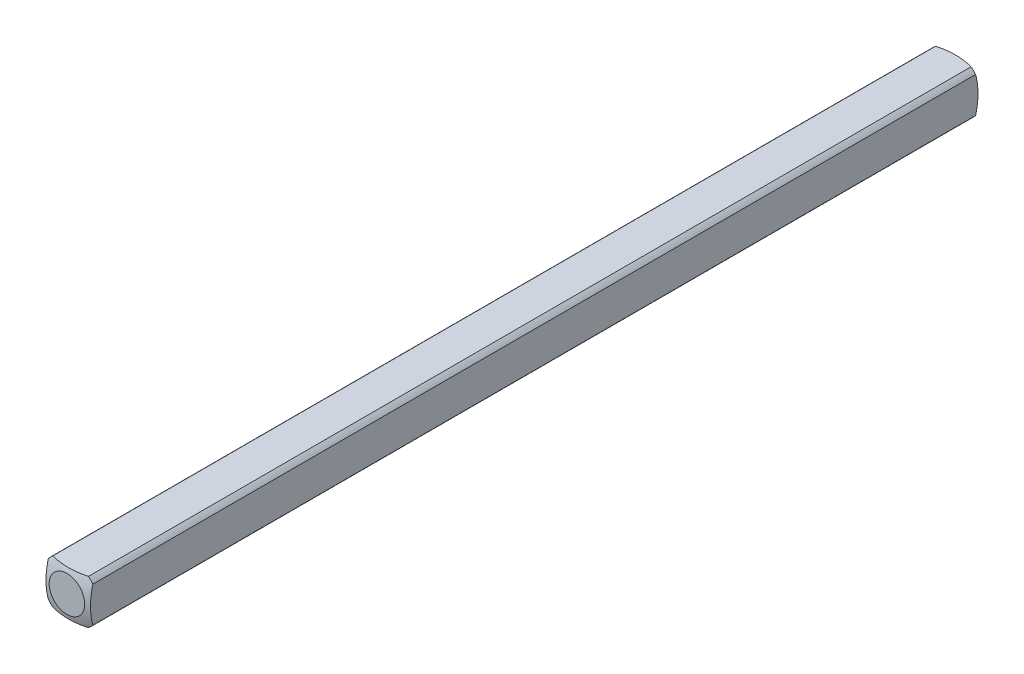
ISO-10303-21;
HEADER;
FILE_DESCRIPTION(('STEP AP214'),'2;1');
FILE_NAME('part.step','',(''),(''),'','','');
FILE_SCHEMA(('AUTOMOTIVE_DESIGN { 1 0 10303 214 1 1 1 1 }'));
ENDSEC;
DATA;
#1=APPLICATION_CONTEXT('core data for automotive mechanical design processes');
#2=APPLICATION_PROTOCOL_DEFINITION('international standard','automotive_design',2000,#1);
#3=PRODUCT_CONTEXT('',#1,'mechanical');
#4=PRODUCT('Part','Part','',(#3));
#5=PRODUCT_RELATED_PRODUCT_CATEGORY('part','',(#4));
#6=PRODUCT_DEFINITION_FORMATION('','',#4);
#7=PRODUCT_DEFINITION_CONTEXT('part definition',#1,'design');
#8=PRODUCT_DEFINITION('design','',#6,#7);
#9=PRODUCT_DEFINITION_SHAPE('','',#8);
#10=(LENGTH_UNIT() NAMED_UNIT(*) SI_UNIT(.MILLI.,.METRE.));
#11=(NAMED_UNIT(*) PLANE_ANGLE_UNIT() SI_UNIT($,.RADIAN.));
#12=(NAMED_UNIT(*) SI_UNIT($,.STERADIAN.) SOLID_ANGLE_UNIT());
#13=UNCERTAINTY_MEASURE_WITH_UNIT(LENGTH_MEASURE(1.E-05),#10,'distance_accuracy_value','');
#14=(GEOMETRIC_REPRESENTATION_CONTEXT(3) GLOBAL_UNCERTAINTY_ASSIGNED_CONTEXT((#13)) GLOBAL_UNIT_ASSIGNED_CONTEXT((#10,
#11,#12)) REPRESENTATION_CONTEXT('',''));
#15=CARTESIAN_POINT('',(0.,0.,0.));
#16=DIRECTION('',(0.,0.,1.));
#17=DIRECTION('',(1.,0.,0.));
#18=AXIS2_PLACEMENT_3D('',#15,#16,#17);
#19=CARTESIAN_POINT('',(-1.5875,-1.5875,31.75));
#20=DIRECTION('',(1.,0.,0.));
#21=DIRECTION('',(0.,0.,-1.));
#22=AXIS2_PLACEMENT_3D('',#19,#20,#21);
#23=PLANE('',#22);
#24=CARTESIAN_POINT('',(-1.5875,0.,4.91912226376204));
#25=DIRECTION('',(1.,0.,0.));
#26=DIRECTION('',(0.,0.,-1.));
#27=AXIS2_PLACEMENT_3D('',#24,#25,#26);
#28=CIRCLE('',#27,4.82558221875869);
#29=CARTESIAN_POINT('',(-1.5875,-1.26841150657032,0.263225357686904));
#30=VERTEX_POINT('',#29);
#31=CARTESIAN_POINT('',(-1.5875,1.26841150657032,0.263225357686907));
#32=VERTEX_POINT('',#31);
#33=EDGE_CURVE('E49',#30,#32,#28,.T.);
#34=ORIENTED_EDGE('',*,*,#33,.F.);
#35=DIRECTION('',(0.,0.,-1.));
#36=VECTOR('',#35,1.);
#37=CARTESIAN_POINT('',(-1.5875,-1.26841150657032,31.75));
#38=LINE('',#37,#36);
#39=CARTESIAN_POINT('',(-1.5875,-1.26841150657032,63.2367746423131));
#40=VERTEX_POINT('',#39);
#41=EDGE_CURVE('E42',#40,#30,#38,.T.);
#42=ORIENTED_EDGE('',*,*,#41,.F.);
#43=CARTESIAN_POINT('',(-1.5875,0.,58.580877736238));
#44=DIRECTION('',(-1.,0.,0.));
#45=DIRECTION('',(0.,0.,1.));
#46=AXIS2_PLACEMENT_3D('',#43,#44,#45);
#47=CIRCLE('',#46,4.82558221875869);
#48=CARTESIAN_POINT('',(-1.5875,1.26841150657032,63.2367746423131));
#49=VERTEX_POINT('',#48);
#50=EDGE_CURVE('E125',#40,#49,#47,.T.);
#51=ORIENTED_EDGE('',*,*,#50,.T.);
#52=DIRECTION('',(0.,0.,-1.));
#53=VECTOR('',#52,1.);
#54=CARTESIAN_POINT('',(-1.5875,1.26841150657032,31.75));
#55=LINE('',#54,#53);
#56=EDGE_CURVE('E113',#32,#49,#55,.F.);
#57=ORIENTED_EDGE('',*,*,#56,.F.);
#58=EDGE_LOOP('',(#34,#42,#51,#57));
#59=FACE_BOUND('',#58,.T.);
#60=ADVANCED_FACE('F35',(#59),#23,.F.);
#61=CARTESIAN_POINT('',(-1.5875,-1.5875,31.75));
#62=DIRECTION('',(0.,1.,0.));
#63=DIRECTION('',(0.,0.,1.));
#64=AXIS2_PLACEMENT_3D('',#61,#62,#63);
#65=PLANE('',#64);
#66=CARTESIAN_POINT('',(0.,-1.5875,4.91912226376204));
#67=DIRECTION('',(0.,1.,0.));
#68=DIRECTION('',(0.,0.,1.));
#69=AXIS2_PLACEMENT_3D('',#66,#67,#68);
#70=CIRCLE('',#69,4.82558221875869);
#71=CARTESIAN_POINT('',(1.26841150657032,-1.5875,0.263225357686905));
#72=VERTEX_POINT('',#71);
#73=CARTESIAN_POINT('',(-1.26841150657032,-1.5875,0.263225357686904));
#74=VERTEX_POINT('',#73);
#75=EDGE_CURVE('E154',#72,#74,#70,.T.);
#76=ORIENTED_EDGE('',*,*,#75,.F.);
#77=DIRECTION('',(0.,0.,-1.));
#78=VECTOR('',#77,1.);
#79=CARTESIAN_POINT('',(1.26841150657032,-1.5875,31.75));
#80=LINE('',#79,#78);
#81=CARTESIAN_POINT('',(1.26841150657032,-1.5875,63.2367746423131));
#82=VERTEX_POINT('',#81);
#83=EDGE_CURVE('E167',#82,#72,#80,.T.);
#84=ORIENTED_EDGE('',*,*,#83,.F.);
#85=CARTESIAN_POINT('',(0.,-1.5875,58.580877736238));
#86=DIRECTION('',(0.,-1.,0.));
#87=DIRECTION('',(0.,0.,-1.));
#88=AXIS2_PLACEMENT_3D('',#85,#86,#87);
#89=CIRCLE('',#88,4.82558221875869);
#90=CARTESIAN_POINT('',(-1.26841150657032,-1.5875,63.2367746423131));
#91=VERTEX_POINT('',#90);
#92=EDGE_CURVE('E136',#82,#91,#89,.T.);
#93=ORIENTED_EDGE('',*,*,#92,.T.);
#94=DIRECTION('',(0.,0.,-1.));
#95=VECTOR('',#94,1.);
#96=CARTESIAN_POINT('',(-1.26841150657032,-1.5875,31.75));
#97=LINE('',#96,#95);
#98=EDGE_CURVE('E165',#74,#91,#97,.F.);
#99=ORIENTED_EDGE('',*,*,#98,.F.);
#100=EDGE_LOOP('',(#76,#84,#93,#99));
#101=FACE_BOUND('',#100,.T.);
#102=ADVANCED_FACE('F177',(#101),#65,.F.);
#103=CARTESIAN_POINT('',(1.5875,-1.5875,31.75));
#104=DIRECTION('',(-1.,0.,0.));
#105=DIRECTION('',(0.,0.,1.));
#106=AXIS2_PLACEMENT_3D('',#103,#104,#105);
#107=PLANE('',#106);
#108=CARTESIAN_POINT('',(1.5875,0.,4.91912226376204));
#109=DIRECTION('',(-1.,0.,0.));
#110=DIRECTION('',(0.,0.,1.));
#111=AXIS2_PLACEMENT_3D('',#108,#109,#110);
#112=CIRCLE('',#111,4.82558221875869);
#113=CARTESIAN_POINT('',(1.5875,1.26841150657032,0.263225357686904));
#114=VERTEX_POINT('',#113);
#115=CARTESIAN_POINT('',(1.5875,-1.26841150657032,0.263225357686904));
#116=VERTEX_POINT('',#115);
#117=EDGE_CURVE('E152',#114,#116,#112,.T.);
#118=ORIENTED_EDGE('',*,*,#117,.F.);
#119=DIRECTION('',(0.,0.,-1.));
#120=VECTOR('',#119,1.);
#121=CARTESIAN_POINT('',(1.5875,1.26841150657032,31.75));
#122=LINE('',#121,#120);
#123=CARTESIAN_POINT('',(1.5875,1.26841150657032,63.2367746423131));
#124=VERTEX_POINT('',#123);
#125=EDGE_CURVE('E162',#124,#114,#122,.T.);
#126=ORIENTED_EDGE('',*,*,#125,.F.);
#127=CARTESIAN_POINT('',(1.5875,0.,58.580877736238));
#128=DIRECTION('',(1.,0.,0.));
#129=DIRECTION('',(0.,0.,-1.));
#130=AXIS2_PLACEMENT_3D('',#127,#128,#129);
#131=CIRCLE('',#130,4.82558221875869);
#132=CARTESIAN_POINT('',(1.5875,-1.26841150657032,63.2367746423131));
#133=VERTEX_POINT('',#132);
#134=EDGE_CURVE('E133',#124,#133,#131,.T.);
#135=ORIENTED_EDGE('',*,*,#134,.T.);
#136=DIRECTION('',(0.,0.,-1.));
#137=VECTOR('',#136,1.);
#138=CARTESIAN_POINT('',(1.5875,-1.26841150657032,31.75));
#139=LINE('',#138,#137);
#140=EDGE_CURVE('E106',#116,#133,#139,.F.);
#141=ORIENTED_EDGE('',*,*,#140,.F.);
#142=EDGE_LOOP('',(#118,#126,#135,#141));
#143=FACE_BOUND('',#142,.T.);
#144=ADVANCED_FACE('F184',(#143),#107,.F.);
#145=CARTESIAN_POINT('',(-1.5875,1.5875,31.75));
#146=DIRECTION('',(0.,-1.,0.));
#147=DIRECTION('',(0.,0.,-1.));
#148=AXIS2_PLACEMENT_3D('',#145,#146,#147);
#149=PLANE('',#148);
#150=CARTESIAN_POINT('',(0.,1.5875,4.91912226376204));
#151=DIRECTION('',(0.,-1.,0.));
#152=DIRECTION('',(0.,0.,-1.));
#153=AXIS2_PLACEMENT_3D('',#150,#151,#152);
#154=CIRCLE('',#153,4.82558221875869);
#155=CARTESIAN_POINT('',(-1.26841150657032,1.5875,0.263225357686904));
#156=VERTEX_POINT('',#155);
#157=CARTESIAN_POINT('',(1.26841150657032,1.5875,0.263225357686904));
#158=VERTEX_POINT('',#157);
#159=EDGE_CURVE('E104',#156,#158,#154,.T.);
#160=ORIENTED_EDGE('',*,*,#159,.F.);
#161=DIRECTION('',(0.,0.,-1.));
#162=VECTOR('',#161,1.);
#163=CARTESIAN_POINT('',(-1.26841150657032,1.5875,31.75));
#164=LINE('',#163,#162);
#165=CARTESIAN_POINT('',(-1.26841150657032,1.5875,63.2367746423131));
#166=VERTEX_POINT('',#165);
#167=EDGE_CURVE('E98',#166,#156,#164,.T.);
#168=ORIENTED_EDGE('',*,*,#167,.F.);
#169=CARTESIAN_POINT('',(0.,1.5875,58.580877736238));
#170=DIRECTION('',(0.,1.,0.));
#171=DIRECTION('',(0.,0.,1.));
#172=AXIS2_PLACEMENT_3D('',#169,#170,#171);
#173=CIRCLE('',#172,4.82558221875869);
#174=CARTESIAN_POINT('',(1.26841150657032,1.5875,63.2367746423131));
#175=VERTEX_POINT('',#174);
#176=EDGE_CURVE('E103',#166,#175,#173,.T.);
#177=ORIENTED_EDGE('',*,*,#176,.T.);
#178=DIRECTION('',(0.,0.,-1.));
#179=VECTOR('',#178,1.);
#180=CARTESIAN_POINT('',(1.26841150657032,1.5875,31.75));
#181=LINE('',#180,#179);
#182=EDGE_CURVE('E107',#158,#175,#181,.F.);
#183=ORIENTED_EDGE('',*,*,#182,.F.);
#184=EDGE_LOOP('',(#160,#168,#177,#183));
#185=FACE_BOUND('',#184,.T.);
#186=ADVANCED_FACE('F100',(#185),#149,.F.);
#187=CARTESIAN_POINT('',(0.,0.,31.75));
#188=DIRECTION('',(0.,0.,-1.));
#189=DIRECTION('',(-1.,0.,0.));
#190=AXIS2_PLACEMENT_3D('',#187,#188,#189);
#191=CYLINDRICAL_SURFACE('',#190,2.032);
#192=ORIENTED_EDGE('',*,*,#41,.T.);
#193=CARTESIAN_POINT('',(0.,0.,0.263225357686904));
#194=DIRECTION('',(0.,0.,1.));
#195=DIRECTION('',(1.,0.,0.));
#196=AXIS2_PLACEMENT_3D('',#193,#194,#195);
#197=CIRCLE('',#196,2.032);
#198=EDGE_CURVE('E149',#30,#74,#197,.T.);
#199=ORIENTED_EDGE('',*,*,#198,.T.);
#200=ORIENTED_EDGE('',*,*,#98,.T.);
#201=CARTESIAN_POINT('',(0.,0.,63.2367746423131));
#202=DIRECTION('',(0.,0.,1.));
#203=DIRECTION('',(1.,0.,0.));
#204=AXIS2_PLACEMENT_3D('',#201,#202,#203);
#205=CIRCLE('',#204,2.032);
#206=EDGE_CURVE('E130',#40,#91,#205,.T.);
#207=ORIENTED_EDGE('',*,*,#206,.F.);
#208=EDGE_LOOP('',(#192,#199,#200,#207));
#209=FACE_BOUND('',#208,.T.);
#210=ADVANCED_FACE('F173',(#209),#191,.T.);
#211=ORIENTED_EDGE('',*,*,#83,.T.);
#212=CARTESIAN_POINT('',(0.,0.,0.263225357686904));
#213=DIRECTION('',(0.,0.,1.));
#214=DIRECTION('',(1.,0.,0.));
#215=AXIS2_PLACEMENT_3D('',#212,#213,#214);
#216=CIRCLE('',#215,2.032);
#217=EDGE_CURVE('E55',#72,#116,#216,.T.);
#218=ORIENTED_EDGE('',*,*,#217,.T.);
#219=ORIENTED_EDGE('',*,*,#140,.T.);
#220=CARTESIAN_POINT('',(0.,0.,63.2367746423131));
#221=DIRECTION('',(0.,0.,1.));
#222=DIRECTION('',(1.,0.,0.));
#223=AXIS2_PLACEMENT_3D('',#220,#221,#222);
#224=CIRCLE('',#223,2.032);
#225=EDGE_CURVE('E139',#82,#133,#224,.T.);
#226=ORIENTED_EDGE('',*,*,#225,.F.);
#227=EDGE_LOOP('',(#211,#218,#219,#226));
#228=FACE_BOUND('',#227,.T.);
#229=ADVANCED_FACE('F180',(#228),#191,.T.);
#230=ORIENTED_EDGE('',*,*,#125,.T.);
#231=CARTESIAN_POINT('',(0.,0.,0.263225357686904));
#232=DIRECTION('',(0.,0.,1.));
#233=DIRECTION('',(1.,0.,0.));
#234=AXIS2_PLACEMENT_3D('',#231,#232,#233);
#235=CIRCLE('',#234,2.032);
#236=EDGE_CURVE('E146',#114,#158,#235,.T.);
#237=ORIENTED_EDGE('',*,*,#236,.T.);
#238=ORIENTED_EDGE('',*,*,#182,.T.);
#239=CARTESIAN_POINT('',(0.,0.,63.2367746423131));
#240=DIRECTION('',(0.,0.,1.));
#241=DIRECTION('',(1.,0.,0.));
#242=AXIS2_PLACEMENT_3D('',#239,#240,#241);
#243=CIRCLE('',#242,2.032);
#244=EDGE_CURVE('E124',#124,#175,#243,.T.);
#245=ORIENTED_EDGE('',*,*,#244,.F.);
#246=EDGE_LOOP('',(#230,#237,#238,#245));
#247=FACE_BOUND('',#246,.T.);
#248=ADVANCED_FACE('F186',(#247),#191,.T.);
#249=ORIENTED_EDGE('',*,*,#167,.T.);
#250=CARTESIAN_POINT('',(0.,0.,0.263225357686904));
#251=DIRECTION('',(0.,0.,1.));
#252=DIRECTION('',(1.,0.,0.));
#253=AXIS2_PLACEMENT_3D('',#250,#251,#252);
#254=CIRCLE('',#253,2.032);
#255=EDGE_CURVE('E12',#156,#32,#254,.T.);
#256=ORIENTED_EDGE('',*,*,#255,.T.);
#257=ORIENTED_EDGE('',*,*,#56,.T.);
#258=CARTESIAN_POINT('',(0.,0.,63.2367746423131));
#259=DIRECTION('',(0.,0.,1.));
#260=DIRECTION('',(1.,0.,0.));
#261=AXIS2_PLACEMENT_3D('',#258,#259,#260);
#262=CIRCLE('',#261,2.032);
#263=EDGE_CURVE('E110',#166,#49,#262,.T.);
#264=ORIENTED_EDGE('',*,*,#263,.F.);
#265=EDGE_LOOP('',(#249,#256,#257,#264));
#266=FACE_BOUND('',#265,.T.);
#267=ADVANCED_FACE('F111',(#266),#191,.T.);
#268=CARTESIAN_POINT('',(0.,0.,4.91912226376204));
#269=DIRECTION('',(0.,0.,1.));
#270=DIRECTION('',(-1.,0.,0.));
#271=AXIS2_PLACEMENT_3D('',#268,#269,#270);
#272=SPHERICAL_SURFACE('',#271,5.08);
#273=CARTESIAN_POINT('',(0.,0.,0.));
#274=DIRECTION('',(0.,0.,-1.));
#275=DIRECTION('',(-1.,0.,0.));
#276=AXIS2_PLACEMENT_3D('',#273,#274,#275);
#277=CIRCLE('',#276,1.26832020963187);
#278=CARTESIAN_POINT('',(-1.26832020963187,0.,0.));
#279=VERTEX_POINT('',#278);
#280=EDGE_CURVE('E157',#279,#279,#277,.T.);
#281=ORIENTED_EDGE('',*,*,#280,.F.);
#282=EDGE_LOOP('',(#281));
#283=FACE_BOUND('',#282,.T.);
#284=ORIENTED_EDGE('',*,*,#75,.T.);
#285=ORIENTED_EDGE('',*,*,#198,.F.);
#286=ORIENTED_EDGE('',*,*,#33,.T.);
#287=ORIENTED_EDGE('',*,*,#255,.F.);
#288=ORIENTED_EDGE('',*,*,#159,.T.);
#289=ORIENTED_EDGE('',*,*,#236,.F.);
#290=ORIENTED_EDGE('',*,*,#117,.T.);
#291=ORIENTED_EDGE('',*,*,#217,.F.);
#292=EDGE_LOOP('',(#284,#285,#286,#287,#288,#289,#290,#291));
#293=FACE_BOUND('',#292,.T.);
#294=ADVANCED_FACE('F187',(#283,#293),#272,.T.);
#295=CARTESIAN_POINT('',(0.,0.,0.));
#296=DIRECTION('',(0.,0.,-1.));
#297=DIRECTION('',(-1.,0.,0.));
#298=AXIS2_PLACEMENT_3D('',#295,#296,#297);
#299=PLANE('',#298);
#300=ORIENTED_EDGE('',*,*,#280,.T.);
#301=EDGE_LOOP('',(#300));
#302=FACE_BOUND('',#301,.T.);
#303=ADVANCED_FACE('F189',(#302),#299,.T.);
#304=CARTESIAN_POINT('',(0.,0.,58.580877736238));
#305=DIRECTION('',(0.,0.,-1.));
#306=DIRECTION('',(-1.,0.,0.));
#307=AXIS2_PLACEMENT_3D('',#304,#305,#306);
#308=SPHERICAL_SURFACE('',#307,5.08);
#309=CARTESIAN_POINT('',(0.,0.,63.5));
#310=DIRECTION('',(0.,0.,-1.));
#311=DIRECTION('',(-1.,0.,0.));
#312=AXIS2_PLACEMENT_3D('',#309,#310,#311);
#313=CIRCLE('',#312,1.26832020963187);
#314=CARTESIAN_POINT('',(-1.26832020963187,0.,63.5));
#315=VERTEX_POINT('',#314);
#316=EDGE_CURVE('E117',#315,#315,#313,.T.);
#317=ORIENTED_EDGE('',*,*,#316,.T.);
#318=EDGE_LOOP('',(#317));
#319=FACE_BOUND('',#318,.T.);
#320=ORIENTED_EDGE('',*,*,#92,.F.);
#321=ORIENTED_EDGE('',*,*,#225,.T.);
#322=ORIENTED_EDGE('',*,*,#134,.F.);
#323=ORIENTED_EDGE('',*,*,#244,.T.);
#324=ORIENTED_EDGE('',*,*,#176,.F.);
#325=ORIENTED_EDGE('',*,*,#263,.T.);
#326=ORIENTED_EDGE('',*,*,#50,.F.);
#327=ORIENTED_EDGE('',*,*,#206,.T.);
#328=EDGE_LOOP('',(#320,#321,#322,#323,#324,#325,#326,#327));
#329=FACE_BOUND('',#328,.T.);
#330=ADVANCED_FACE('F121',(#319,#329),#308,.T.);
#331=CARTESIAN_POINT('',(0.,0.,63.5));
#332=DIRECTION('',(0.,0.,1.));
#333=DIRECTION('',(-1.,0.,0.));
#334=AXIS2_PLACEMENT_3D('',#331,#332,#333);
#335=PLANE('',#334);
#336=ORIENTED_EDGE('',*,*,#316,.F.);
#337=EDGE_LOOP('',(#336));
#338=FACE_BOUND('',#337,.T.);
#339=ADVANCED_FACE('F234',(#338),#335,.T.);
#340=CLOSED_SHELL('',(#60,#102,#144,#186,#210,#229,#248,#267,#294,#303,#330,#339));
#341=MANIFOLD_SOLID_BREP('B2',#340);
#342=ADVANCED_BREP_SHAPE_REPRESENTATION('',(#18,#341),#14);
#343=SHAPE_DEFINITION_REPRESENTATION(#9,#342);
ENDSEC;
END-ISO-10303-21;
